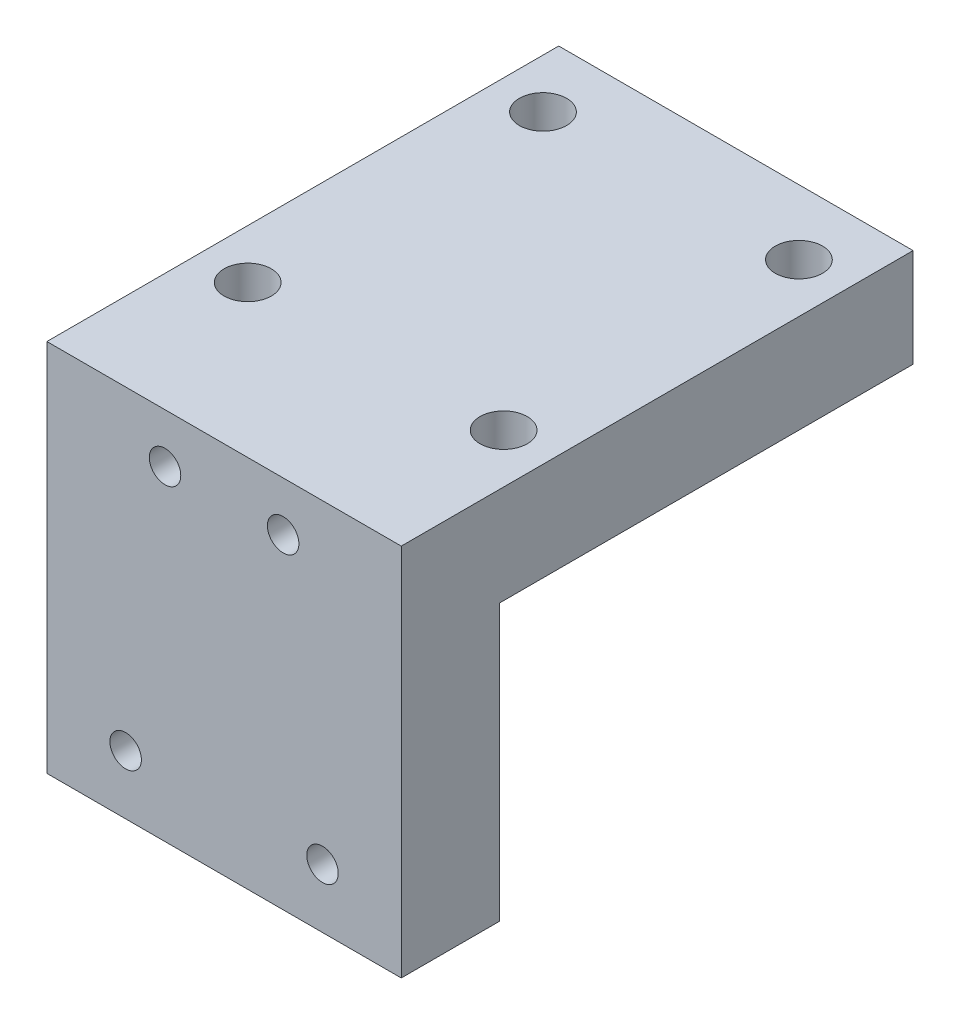
ISO-10303-21;
HEADER;
FILE_DESCRIPTION(('STEP AP214'),'2;1');
FILE_NAME('part.step','',(''),(''),'','','');
FILE_SCHEMA(('AUTOMOTIVE_DESIGN { 1 0 10303 214 1 1 1 1 }'));
ENDSEC;
DATA;
#1=APPLICATION_CONTEXT('core data for automotive mechanical design processes');
#2=APPLICATION_PROTOCOL_DEFINITION('international standard','automotive_design',2000,#1);
#3=PRODUCT_CONTEXT('',#1,'mechanical');
#4=PRODUCT('Part','Part','',(#3));
#5=PRODUCT_RELATED_PRODUCT_CATEGORY('part','',(#4));
#6=PRODUCT_DEFINITION_FORMATION('','',#4);
#7=PRODUCT_DEFINITION_CONTEXT('part definition',#1,'design');
#8=PRODUCT_DEFINITION('design','',#6,#7);
#9=PRODUCT_DEFINITION_SHAPE('','',#8);
#10=(LENGTH_UNIT() NAMED_UNIT(*) SI_UNIT(.MILLI.,.METRE.));
#11=(NAMED_UNIT(*) PLANE_ANGLE_UNIT() SI_UNIT($,.RADIAN.));
#12=(NAMED_UNIT(*) SI_UNIT($,.STERADIAN.) SOLID_ANGLE_UNIT());
#13=UNCERTAINTY_MEASURE_WITH_UNIT(LENGTH_MEASURE(1.E-05),#10,'distance_accuracy_value','');
#14=(GEOMETRIC_REPRESENTATION_CONTEXT(3) GLOBAL_UNCERTAINTY_ASSIGNED_CONTEXT((#13)) GLOBAL_UNIT_ASSIGNED_CONTEXT((#10,
#11,#12)) REPRESENTATION_CONTEXT('',''));
#15=CARTESIAN_POINT('',(0.,0.,0.));
#16=DIRECTION('',(0.,0.,1.));
#17=DIRECTION('',(1.,0.,0.));
#18=AXIS2_PLACEMENT_3D('',#15,#16,#17);
#19=CARTESIAN_POINT('',(0.,5.,0.));
#20=DIRECTION('',(1.,0.,0.));
#21=DIRECTION('',(0.,0.,-1.));
#22=AXIS2_PLACEMENT_3D('',#19,#20,#21);
#23=PLANE('',#22);
#24=DIRECTION('',(0.,0.,1.));
#25=VECTOR('',#24,1.);
#26=CARTESIAN_POINT('',(0.,0.,0.));
#27=LINE('',#26,#25);
#28=CARTESIAN_POINT('',(0.,0.,-26.));
#29=VERTEX_POINT('',#28);
#30=CARTESIAN_POINT('',(0.,0.,-5.));
#31=VERTEX_POINT('',#30);
#32=EDGE_CURVE('E176',#29,#31,#27,.T.);
#33=ORIENTED_EDGE('',*,*,#32,.T.);
#34=DIRECTION('',(0.,1.,0.));
#35=VECTOR('',#34,1.);
#36=CARTESIAN_POINT('',(0.,-14.,-5.));
#37=LINE('',#36,#35);
#38=CARTESIAN_POINT('',(0.,-14.,-5.));
#39=VERTEX_POINT('',#38);
#40=EDGE_CURVE('E171',#39,#31,#37,.T.);
#41=ORIENTED_EDGE('',*,*,#40,.F.);
#42=DIRECTION('',(0.,0.,-1.));
#43=VECTOR('',#42,1.);
#44=CARTESIAN_POINT('',(0.,-14.,0.));
#45=LINE('',#44,#43);
#46=CARTESIAN_POINT('',(0.,-14.,0.));
#47=VERTEX_POINT('',#46);
#48=EDGE_CURVE('E154',#47,#39,#45,.T.);
#49=ORIENTED_EDGE('',*,*,#48,.F.);
#50=DIRECTION('',(0.,-1.,0.));
#51=VECTOR('',#50,1.);
#52=CARTESIAN_POINT('',(0.,5.,0.));
#53=LINE('',#52,#51);
#54=CARTESIAN_POINT('',(0.,5.,0.));
#55=VERTEX_POINT('',#54);
#56=EDGE_CURVE('E11',#55,#47,#53,.T.);
#57=ORIENTED_EDGE('',*,*,#56,.F.);
#58=DIRECTION('',(0.,0.,1.));
#59=VECTOR('',#58,1.);
#60=CARTESIAN_POINT('',(0.,5.,0.));
#61=LINE('',#60,#59);
#62=CARTESIAN_POINT('',(0.,5.,-26.));
#63=VERTEX_POINT('',#62);
#64=EDGE_CURVE('E161',#63,#55,#61,.T.);
#65=ORIENTED_EDGE('',*,*,#64,.F.);
#66=DIRECTION('',(0.,-1.,0.));
#67=VECTOR('',#66,1.);
#68=CARTESIAN_POINT('',(0.,5.,-26.));
#69=LINE('',#68,#67);
#70=EDGE_CURVE('E230',#63,#29,#69,.T.);
#71=ORIENTED_EDGE('',*,*,#70,.T.);
#72=EDGE_LOOP('',(#33,#41,#49,#57,#65,#71));
#73=FACE_BOUND('',#72,.T.);
#74=ADVANCED_FACE('F33',(#73),#23,.F.);
#75=CARTESIAN_POINT('',(0.,5.,0.));
#76=DIRECTION('',(0.,0.,-1.));
#77=DIRECTION('',(-1.,0.,0.));
#78=AXIS2_PLACEMENT_3D('',#75,#76,#77);
#79=PLANE('',#78);
#80=CARTESIAN_POINT('',(6.,2.5,0.));
#81=DIRECTION('',(0.,0.,1.));
#82=DIRECTION('',(1.,0.,0.));
#83=AXIS2_PLACEMENT_3D('',#80,#81,#82);
#84=CIRCLE('',#83,0.799999999999999);
#85=CARTESIAN_POINT('',(6.8,2.5,0.));
#86=VERTEX_POINT('',#85);
#87=EDGE_CURVE('E111',#86,#86,#84,.T.);
#88=ORIENTED_EDGE('',*,*,#87,.F.);
#89=EDGE_LOOP('',(#88));
#90=FACE_BOUND('',#89,.T.);
#91=CARTESIAN_POINT('',(12.,2.5,0.));
#92=DIRECTION('',(0.,0.,1.));
#93=DIRECTION('',(1.,0.,0.));
#94=AXIS2_PLACEMENT_3D('',#91,#92,#93);
#95=CIRCLE('',#94,0.799999999999999);
#96=CARTESIAN_POINT('',(12.8,2.5,0.));
#97=VERTEX_POINT('',#96);
#98=EDGE_CURVE('E110',#97,#97,#95,.T.);
#99=ORIENTED_EDGE('',*,*,#98,.F.);
#100=EDGE_LOOP('',(#99));
#101=FACE_BOUND('',#100,.T.);
#102=CARTESIAN_POINT('',(4.,-11.,0.));
#103=DIRECTION('',(0.,0.,1.));
#104=DIRECTION('',(1.,0.,0.));
#105=AXIS2_PLACEMENT_3D('',#102,#103,#104);
#106=CIRCLE('',#105,0.799999999999999);
#107=CARTESIAN_POINT('',(4.8,-11.,0.));
#108=VERTEX_POINT('',#107);
#109=EDGE_CURVE('E121',#108,#108,#106,.T.);
#110=ORIENTED_EDGE('',*,*,#109,.F.);
#111=EDGE_LOOP('',(#110));
#112=FACE_BOUND('',#111,.T.);
#113=CARTESIAN_POINT('',(14.,-11.,0.));
#114=DIRECTION('',(0.,0.,1.));
#115=DIRECTION('',(1.,0.,0.));
#116=AXIS2_PLACEMENT_3D('',#113,#114,#115);
#117=CIRCLE('',#116,0.799999999999999);
#118=CARTESIAN_POINT('',(14.8,-11.,0.));
#119=VERTEX_POINT('',#118);
#120=EDGE_CURVE('E124',#119,#119,#117,.T.);
#121=ORIENTED_EDGE('',*,*,#120,.F.);
#122=EDGE_LOOP('',(#121));
#123=FACE_BOUND('',#122,.T.);
#124=ORIENTED_EDGE('',*,*,#56,.T.);
#125=DIRECTION('',(-1.,0.,0.));
#126=VECTOR('',#125,1.);
#127=CARTESIAN_POINT('',(18.,-14.,0.));
#128=LINE('',#127,#126);
#129=CARTESIAN_POINT('',(18.,-14.,0.));
#130=VERTEX_POINT('',#129);
#131=EDGE_CURVE('E151',#130,#47,#128,.T.);
#132=ORIENTED_EDGE('',*,*,#131,.F.);
#133=DIRECTION('',(0.,-1.,0.));
#134=VECTOR('',#133,1.);
#135=CARTESIAN_POINT('',(18.,5.,0.));
#136=LINE('',#135,#134);
#137=CARTESIAN_POINT('',(18.,5.,0.));
#138=VERTEX_POINT('',#137);
#139=EDGE_CURVE('E41',#138,#130,#136,.T.);
#140=ORIENTED_EDGE('',*,*,#139,.F.);
#141=DIRECTION('',(1.,0.,0.));
#142=VECTOR('',#141,1.);
#143=CARTESIAN_POINT('',(0.,5.,0.));
#144=LINE('',#143,#142);
#145=EDGE_CURVE('E80',#55,#138,#144,.T.);
#146=ORIENTED_EDGE('',*,*,#145,.F.);
#147=EDGE_LOOP('',(#124,#132,#140,#146));
#148=FACE_BOUND('',#147,.T.);
#149=ADVANCED_FACE('F218',(#90,#101,#112,#123,#148),#79,.F.);
#150=CARTESIAN_POINT('',(18.,5.,0.));
#151=DIRECTION('',(-1.,0.,0.));
#152=DIRECTION('',(0.,0.,1.));
#153=AXIS2_PLACEMENT_3D('',#150,#151,#152);
#154=PLANE('',#153);
#155=ORIENTED_EDGE('',*,*,#139,.T.);
#156=DIRECTION('',(0.,0.,1.));
#157=VECTOR('',#156,1.);
#158=CARTESIAN_POINT('',(18.,-14.,0.));
#159=LINE('',#158,#157);
#160=CARTESIAN_POINT('',(18.,-14.,-5.));
#161=VERTEX_POINT('',#160);
#162=EDGE_CURVE('E148',#161,#130,#159,.T.);
#163=ORIENTED_EDGE('',*,*,#162,.F.);
#164=DIRECTION('',(0.,1.,0.));
#165=VECTOR('',#164,1.);
#166=CARTESIAN_POINT('',(18.,-14.,-5.));
#167=LINE('',#166,#165);
#168=CARTESIAN_POINT('',(18.,0.,-5.));
#169=VERTEX_POINT('',#168);
#170=EDGE_CURVE('E158',#161,#169,#167,.T.);
#171=ORIENTED_EDGE('',*,*,#170,.T.);
#172=DIRECTION('',(0.,0.,-1.));
#173=VECTOR('',#172,1.);
#174=CARTESIAN_POINT('',(18.,0.,0.));
#175=LINE('',#174,#173);
#176=CARTESIAN_POINT('',(18.,0.,-26.));
#177=VERTEX_POINT('',#176);
#178=EDGE_CURVE('E166',#169,#177,#175,.T.);
#179=ORIENTED_EDGE('',*,*,#178,.T.);
#180=DIRECTION('',(0.,-1.,0.));
#181=VECTOR('',#180,1.);
#182=CARTESIAN_POINT('',(18.,5.,-26.));
#183=LINE('',#182,#181);
#184=CARTESIAN_POINT('',(18.,5.,-26.));
#185=VERTEX_POINT('',#184);
#186=EDGE_CURVE('E228',#185,#177,#183,.T.);
#187=ORIENTED_EDGE('',*,*,#186,.F.);
#188=DIRECTION('',(0.,0.,-1.));
#189=VECTOR('',#188,1.);
#190=CARTESIAN_POINT('',(18.,5.,0.));
#191=LINE('',#190,#189);
#192=EDGE_CURVE('E227',#138,#185,#191,.T.);
#193=ORIENTED_EDGE('',*,*,#192,.F.);
#194=EDGE_LOOP('',(#155,#163,#171,#179,#187,#193));
#195=FACE_BOUND('',#194,.T.);
#196=ADVANCED_FACE('F224',(#195),#154,.F.);
#197=CARTESIAN_POINT('',(0.,5.,-26.));
#198=DIRECTION('',(0.,0.,1.));
#199=DIRECTION('',(1.,0.,0.));
#200=AXIS2_PLACEMENT_3D('',#197,#198,#199);
#201=PLANE('',#200);
#202=DIRECTION('',(-1.,0.,0.));
#203=VECTOR('',#202,1.);
#204=CARTESIAN_POINT('',(0.,0.,-26.));
#205=LINE('',#204,#203);
#206=EDGE_CURVE('E73',#177,#29,#205,.T.);
#207=ORIENTED_EDGE('',*,*,#206,.T.);
#208=ORIENTED_EDGE('',*,*,#70,.F.);
#209=DIRECTION('',(-1.,0.,0.));
#210=VECTOR('',#209,1.);
#211=CARTESIAN_POINT('',(0.,5.,-26.));
#212=LINE('',#211,#210);
#213=EDGE_CURVE('E58',#185,#63,#212,.T.);
#214=ORIENTED_EDGE('',*,*,#213,.F.);
#215=ORIENTED_EDGE('',*,*,#186,.T.);
#216=EDGE_LOOP('',(#207,#208,#214,#215));
#217=FACE_BOUND('',#216,.T.);
#218=ADVANCED_FACE('F209',(#217),#201,.F.);
#219=CARTESIAN_POINT('',(0.,5.,-26.));
#220=DIRECTION('',(0.,-1.,0.));
#221=DIRECTION('',(0.,0.,-1.));
#222=AXIS2_PLACEMENT_3D('',#219,#220,#221);
#223=PLANE('',#222);
#224=CARTESIAN_POINT('',(2.5,5.,-7.7));
#225=DIRECTION('',(0.,1.,0.));
#226=DIRECTION('',(0.,0.,1.));
#227=AXIS2_PLACEMENT_3D('',#224,#225,#226);
#228=CIRCLE('',#227,1.19999999999999);
#229=CARTESIAN_POINT('',(2.5,5.,-6.50000000000001));
#230=VERTEX_POINT('',#229);
#231=EDGE_CURVE('E130',#230,#230,#228,.T.);
#232=ORIENTED_EDGE('',*,*,#231,.F.);
#233=EDGE_LOOP('',(#232));
#234=FACE_BOUND('',#233,.T.);
#235=CARTESIAN_POINT('',(15.5,5.,-7.7));
#236=DIRECTION('',(0.,1.,0.));
#237=DIRECTION('',(0.,0.,1.));
#238=AXIS2_PLACEMENT_3D('',#235,#236,#237);
#239=CIRCLE('',#238,1.19999999999999);
#240=CARTESIAN_POINT('',(15.5,5.,-6.50000000000001));
#241=VERTEX_POINT('',#240);
#242=EDGE_CURVE('E134',#241,#241,#239,.T.);
#243=ORIENTED_EDGE('',*,*,#242,.F.);
#244=EDGE_LOOP('',(#243));
#245=FACE_BOUND('',#244,.T.);
#246=CARTESIAN_POINT('',(2.5,5.,-22.7));
#247=DIRECTION('',(0.,1.,0.));
#248=DIRECTION('',(0.,0.,1.));
#249=AXIS2_PLACEMENT_3D('',#246,#247,#248);
#250=CIRCLE('',#249,1.19999999999999);
#251=CARTESIAN_POINT('',(2.5,5.,-21.5));
#252=VERTEX_POINT('',#251);
#253=EDGE_CURVE('E138',#252,#252,#250,.T.);
#254=ORIENTED_EDGE('',*,*,#253,.F.);
#255=EDGE_LOOP('',(#254));
#256=FACE_BOUND('',#255,.T.);
#257=CARTESIAN_POINT('',(15.5,5.,-22.7));
#258=DIRECTION('',(0.,1.,0.));
#259=DIRECTION('',(0.,0.,1.));
#260=AXIS2_PLACEMENT_3D('',#257,#258,#259);
#261=CIRCLE('',#260,1.19999999999999);
#262=CARTESIAN_POINT('',(15.5,5.,-21.5));
#263=VERTEX_POINT('',#262);
#264=EDGE_CURVE('E142',#263,#263,#261,.T.);
#265=ORIENTED_EDGE('',*,*,#264,.F.);
#266=EDGE_LOOP('',(#265));
#267=FACE_BOUND('',#266,.T.);
#268=ORIENTED_EDGE('',*,*,#64,.T.);
#269=ORIENTED_EDGE('',*,*,#145,.T.);
#270=ORIENTED_EDGE('',*,*,#192,.T.);
#271=ORIENTED_EDGE('',*,*,#213,.T.);
#272=EDGE_LOOP('',(#268,#269,#270,#271));
#273=FACE_BOUND('',#272,.T.);
#274=ADVANCED_FACE('F192',(#234,#245,#256,#267,#273),#223,.F.);
#275=CARTESIAN_POINT('',(0.,0.,-26.));
#276=DIRECTION('',(0.,-1.,0.));
#277=DIRECTION('',(0.,0.,-1.));
#278=AXIS2_PLACEMENT_3D('',#275,#276,#277);
#279=PLANE('',#278);
#280=CARTESIAN_POINT('',(2.5,0.,-7.7));
#281=DIRECTION('',(0.,-1.,0.));
#282=DIRECTION('',(0.,0.,-1.));
#283=AXIS2_PLACEMENT_3D('',#280,#281,#282);
#284=CIRCLE('',#283,1.19999999999999);
#285=CARTESIAN_POINT('',(2.5,0.,-8.89999999999999));
#286=VERTEX_POINT('',#285);
#287=EDGE_CURVE('E133',#286,#286,#284,.T.);
#288=ORIENTED_EDGE('',*,*,#287,.F.);
#289=EDGE_LOOP('',(#288));
#290=FACE_BOUND('',#289,.T.);
#291=CARTESIAN_POINT('',(15.5,0.,-7.7));
#292=DIRECTION('',(0.,-1.,0.));
#293=DIRECTION('',(0.,0.,-1.));
#294=AXIS2_PLACEMENT_3D('',#291,#292,#293);
#295=CIRCLE('',#294,1.19999999999999);
#296=CARTESIAN_POINT('',(15.5,0.,-8.89999999999999));
#297=VERTEX_POINT('',#296);
#298=EDGE_CURVE('E137',#297,#297,#295,.T.);
#299=ORIENTED_EDGE('',*,*,#298,.F.);
#300=EDGE_LOOP('',(#299));
#301=FACE_BOUND('',#300,.T.);
#302=CARTESIAN_POINT('',(2.5,0.,-22.7));
#303=DIRECTION('',(0.,-1.,0.));
#304=DIRECTION('',(0.,0.,-1.));
#305=AXIS2_PLACEMENT_3D('',#302,#303,#304);
#306=CIRCLE('',#305,1.19999999999999);
#307=CARTESIAN_POINT('',(2.5,0.,-23.9));
#308=VERTEX_POINT('',#307);
#309=EDGE_CURVE('E141',#308,#308,#306,.T.);
#310=ORIENTED_EDGE('',*,*,#309,.F.);
#311=EDGE_LOOP('',(#310));
#312=FACE_BOUND('',#311,.T.);
#313=CARTESIAN_POINT('',(15.5,0.,-22.7));
#314=DIRECTION('',(0.,-1.,0.));
#315=DIRECTION('',(0.,0.,-1.));
#316=AXIS2_PLACEMENT_3D('',#313,#314,#315);
#317=CIRCLE('',#316,1.19999999999999);
#318=CARTESIAN_POINT('',(15.5,0.,-23.9));
#319=VERTEX_POINT('',#318);
#320=EDGE_CURVE('E145',#319,#319,#317,.T.);
#321=ORIENTED_EDGE('',*,*,#320,.F.);
#322=EDGE_LOOP('',(#321));
#323=FACE_BOUND('',#322,.T.);
#324=DIRECTION('',(1.,0.,0.));
#325=VECTOR('',#324,1.);
#326=CARTESIAN_POINT('',(18.,0.,-5.));
#327=LINE('',#326,#325);
#328=EDGE_CURVE('E49',#31,#169,#327,.T.);
#329=ORIENTED_EDGE('',*,*,#328,.F.);
#330=ORIENTED_EDGE('',*,*,#32,.F.);
#331=ORIENTED_EDGE('',*,*,#206,.F.);
#332=ORIENTED_EDGE('',*,*,#178,.F.);
#333=EDGE_LOOP('',(#329,#330,#331,#332));
#334=FACE_BOUND('',#333,.T.);
#335=ADVANCED_FACE('F188',(#290,#301,#312,#323,#334),#279,.T.);
#336=CARTESIAN_POINT('',(18.,-14.,-5.));
#337=DIRECTION('',(0.,0.,1.));
#338=DIRECTION('',(1.,0.,0.));
#339=AXIS2_PLACEMENT_3D('',#336,#337,#338);
#340=PLANE('',#339);
#341=CARTESIAN_POINT('',(4.,-11.,-5.));
#342=DIRECTION('',(0.,0.,1.));
#343=DIRECTION('',(1.,0.,0.));
#344=AXIS2_PLACEMENT_3D('',#341,#342,#343);
#345=CIRCLE('',#344,0.799999999999998);
#346=CARTESIAN_POINT('',(4.8,-11.,-5.));
#347=VERTEX_POINT('',#346);
#348=EDGE_CURVE('E36',#347,#347,#345,.T.);
#349=ORIENTED_EDGE('',*,*,#348,.T.);
#350=EDGE_LOOP('',(#349));
#351=FACE_BOUND('',#350,.T.);
#352=CARTESIAN_POINT('',(14.,-11.,-5.));
#353=DIRECTION('',(0.,0.,1.));
#354=DIRECTION('',(1.,0.,0.));
#355=AXIS2_PLACEMENT_3D('',#352,#353,#354);
#356=CIRCLE('',#355,0.799999999999999);
#357=CARTESIAN_POINT('',(14.8,-11.,-5.));
#358=VERTEX_POINT('',#357);
#359=EDGE_CURVE('E127',#358,#358,#356,.T.);
#360=ORIENTED_EDGE('',*,*,#359,.T.);
#361=EDGE_LOOP('',(#360));
#362=FACE_BOUND('',#361,.T.);
#363=ORIENTED_EDGE('',*,*,#328,.T.);
#364=ORIENTED_EDGE('',*,*,#170,.F.);
#365=DIRECTION('',(1.,0.,0.));
#366=VECTOR('',#365,1.);
#367=CARTESIAN_POINT('',(18.,-14.,-5.));
#368=LINE('',#367,#366);
#369=EDGE_CURVE('E156',#39,#161,#368,.T.);
#370=ORIENTED_EDGE('',*,*,#369,.F.);
#371=ORIENTED_EDGE('',*,*,#40,.T.);
#372=EDGE_LOOP('',(#363,#364,#370,#371));
#373=FACE_BOUND('',#372,.T.);
#374=ADVANCED_FACE('F191',(#351,#362,#373),#340,.F.);
#375=CARTESIAN_POINT('',(18.,-14.,-5.));
#376=DIRECTION('',(0.,1.,0.));
#377=DIRECTION('',(0.,0.,1.));
#378=AXIS2_PLACEMENT_3D('',#375,#376,#377);
#379=PLANE('',#378);
#380=ORIENTED_EDGE('',*,*,#162,.T.);
#381=ORIENTED_EDGE('',*,*,#131,.T.);
#382=ORIENTED_EDGE('',*,*,#48,.T.);
#383=ORIENTED_EDGE('',*,*,#369,.T.);
#384=EDGE_LOOP('',(#380,#381,#382,#383));
#385=FACE_BOUND('',#384,.T.);
#386=ADVANCED_FACE('F204',(#385),#379,.F.);
#387=CARTESIAN_POINT('',(15.5,5.,-22.7));
#388=DIRECTION('',(0.,1.,0.));
#389=DIRECTION('',(0.,0.,1.));
#390=AXIS2_PLACEMENT_3D('',#387,#388,#389);
#391=CYLINDRICAL_SURFACE('',#390,1.19999999999999);
#392=ORIENTED_EDGE('',*,*,#320,.T.);
#393=EDGE_LOOP('',(#392));
#394=FACE_BOUND('',#393,.T.);
#395=ORIENTED_EDGE('',*,*,#264,.T.);
#396=EDGE_LOOP('',(#395));
#397=FACE_BOUND('',#396,.T.);
#398=ADVANCED_FACE('F200',(#394,#397),#391,.F.);
#399=CARTESIAN_POINT('',(2.5,5.,-22.7));
#400=DIRECTION('',(0.,1.,0.));
#401=DIRECTION('',(0.,0.,1.));
#402=AXIS2_PLACEMENT_3D('',#399,#400,#401);
#403=CYLINDRICAL_SURFACE('',#402,1.19999999999999);
#404=ORIENTED_EDGE('',*,*,#309,.T.);
#405=EDGE_LOOP('',(#404));
#406=FACE_BOUND('',#405,.T.);
#407=ORIENTED_EDGE('',*,*,#253,.T.);
#408=EDGE_LOOP('',(#407));
#409=FACE_BOUND('',#408,.T.);
#410=ADVANCED_FACE('F203',(#406,#409),#403,.F.);
#411=CARTESIAN_POINT('',(15.5,5.,-7.7));
#412=DIRECTION('',(0.,1.,0.));
#413=DIRECTION('',(0.,0.,1.));
#414=AXIS2_PLACEMENT_3D('',#411,#412,#413);
#415=CYLINDRICAL_SURFACE('',#414,1.19999999999999);
#416=ORIENTED_EDGE('',*,*,#298,.T.);
#417=EDGE_LOOP('',(#416));
#418=FACE_BOUND('',#417,.T.);
#419=ORIENTED_EDGE('',*,*,#242,.T.);
#420=EDGE_LOOP('',(#419));
#421=FACE_BOUND('',#420,.T.);
#422=ADVANCED_FACE('F279',(#418,#421),#415,.F.);
#423=CARTESIAN_POINT('',(2.5,5.,-7.7));
#424=DIRECTION('',(0.,1.,0.));
#425=DIRECTION('',(0.,0.,1.));
#426=AXIS2_PLACEMENT_3D('',#423,#424,#425);
#427=CYLINDRICAL_SURFACE('',#426,1.19999999999999);
#428=ORIENTED_EDGE('',*,*,#287,.T.);
#429=EDGE_LOOP('',(#428));
#430=FACE_BOUND('',#429,.T.);
#431=ORIENTED_EDGE('',*,*,#231,.T.);
#432=EDGE_LOOP('',(#431));
#433=FACE_BOUND('',#432,.T.);
#434=ADVANCED_FACE('F185',(#430,#433),#427,.F.);
#435=CARTESIAN_POINT('',(14.,-11.,0.));
#436=DIRECTION('',(0.,0.,1.));
#437=DIRECTION('',(1.,0.,0.));
#438=AXIS2_PLACEMENT_3D('',#435,#436,#437);
#439=CYLINDRICAL_SURFACE('',#438,0.799999999999999);
#440=ORIENTED_EDGE('',*,*,#120,.T.);
#441=EDGE_LOOP('',(#440));
#442=FACE_BOUND('',#441,.T.);
#443=ORIENTED_EDGE('',*,*,#359,.F.);
#444=EDGE_LOOP('',(#443));
#445=FACE_BOUND('',#444,.T.);
#446=ADVANCED_FACE('F260',(#442,#445),#439,.F.);
#447=CARTESIAN_POINT('',(4.,-11.,0.));
#448=DIRECTION('',(0.,0.,1.));
#449=DIRECTION('',(1.,0.,0.));
#450=AXIS2_PLACEMENT_3D('',#447,#448,#449);
#451=CYLINDRICAL_SURFACE('',#450,0.799999999999998);
#452=ORIENTED_EDGE('',*,*,#109,.T.);
#453=EDGE_LOOP('',(#452));
#454=FACE_BOUND('',#453,.T.);
#455=ORIENTED_EDGE('',*,*,#348,.F.);
#456=EDGE_LOOP('',(#455));
#457=FACE_BOUND('',#456,.T.);
#458=ADVANCED_FACE('F263',(#454,#457),#451,.F.);
#459=CARTESIAN_POINT('',(12.,2.5,-11.2));
#460=DIRECTION('',(0.,0.,1.));
#461=DIRECTION('',(1.,0.,0.));
#462=AXIS2_PLACEMENT_3D('',#459,#460,#461);
#463=CONICAL_SURFACE('',#462,0.799999999999999,1.02974425867665);
#464=CARTESIAN_POINT('',(12.,2.5,-11.680688495222));
#465=VERTEX_POINT('',#464);
#466=VERTEX_LOOP('',#465);
#467=FACE_BOUND('',#466,.T.);
#468=CARTESIAN_POINT('',(12.,2.5,-11.2));
#469=DIRECTION('',(0.,0.,1.));
#470=DIRECTION('',(1.,0.,0.));
#471=AXIS2_PLACEMENT_3D('',#468,#469,#470);
#472=CIRCLE('',#471,0.799999999999999);
#473=CARTESIAN_POINT('',(12.8,2.5,-11.2));
#474=VERTEX_POINT('',#473);
#475=EDGE_CURVE('E114',#474,#474,#472,.T.);
#476=ORIENTED_EDGE('',*,*,#475,.T.);
#477=EDGE_LOOP('',(#476));
#478=FACE_BOUND('',#477,.T.);
#479=ADVANCED_FACE('F288',(#467,#478),#463,.F.);
#480=CARTESIAN_POINT('',(12.,2.5,0.));
#481=DIRECTION('',(0.,0.,1.));
#482=DIRECTION('',(1.,0.,0.));
#483=AXIS2_PLACEMENT_3D('',#480,#481,#482);
#484=CYLINDRICAL_SURFACE('',#483,0.799999999999999);
#485=ORIENTED_EDGE('',*,*,#475,.F.);
#486=EDGE_LOOP('',(#485));
#487=FACE_BOUND('',#486,.T.);
#488=ORIENTED_EDGE('',*,*,#98,.T.);
#489=EDGE_LOOP('',(#488));
#490=FACE_BOUND('',#489,.T.);
#491=ADVANCED_FACE('F104',(#487,#490),#484,.F.);
#492=CARTESIAN_POINT('',(6.,2.5,-11.2));
#493=DIRECTION('',(0.,0.,1.));
#494=DIRECTION('',(1.,0.,0.));
#495=AXIS2_PLACEMENT_3D('',#492,#493,#494);
#496=CONICAL_SURFACE('',#495,0.799999999999998,1.02974425867665);
#497=CARTESIAN_POINT('',(6.,2.5,-11.680688495222));
#498=VERTEX_POINT('',#497);
#499=VERTEX_LOOP('',#498);
#500=FACE_BOUND('',#499,.T.);
#501=CARTESIAN_POINT('',(6.,2.5,-11.2));
#502=DIRECTION('',(0.,0.,1.));
#503=DIRECTION('',(1.,0.,0.));
#504=AXIS2_PLACEMENT_3D('',#501,#502,#503);
#505=CIRCLE('',#504,0.799999999999998);
#506=CARTESIAN_POINT('',(6.8,2.5,-11.2));
#507=VERTEX_POINT('',#506);
#508=EDGE_CURVE('E108',#507,#507,#505,.T.);
#509=ORIENTED_EDGE('',*,*,#508,.T.);
#510=EDGE_LOOP('',(#509));
#511=FACE_BOUND('',#510,.T.);
#512=ADVANCED_FACE('F100',(#500,#511),#496,.F.);
#513=CARTESIAN_POINT('',(6.,2.5,0.));
#514=DIRECTION('',(0.,0.,1.));
#515=DIRECTION('',(1.,0.,0.));
#516=AXIS2_PLACEMENT_3D('',#513,#514,#515);
#517=CYLINDRICAL_SURFACE('',#516,0.799999999999998);
#518=ORIENTED_EDGE('',*,*,#508,.F.);
#519=EDGE_LOOP('',(#518));
#520=FACE_BOUND('',#519,.T.);
#521=ORIENTED_EDGE('',*,*,#87,.T.);
#522=EDGE_LOOP('',(#521));
#523=FACE_BOUND('',#522,.T.);
#524=ADVANCED_FACE('F103',(#520,#523),#517,.F.);
#525=CLOSED_SHELL('',(#74,#149,#196,#218,#274,#335,#374,#386,#398,#410,#422,#434,#446,#458,#479,
#491,#512,#524));
#526=MANIFOLD_SOLID_BREP('B2',#525);
#527=ADVANCED_BREP_SHAPE_REPRESENTATION('',(#18,#526),#14);
#528=SHAPE_DEFINITION_REPRESENTATION(#9,#527);
ENDSEC;
END-ISO-10303-21;
